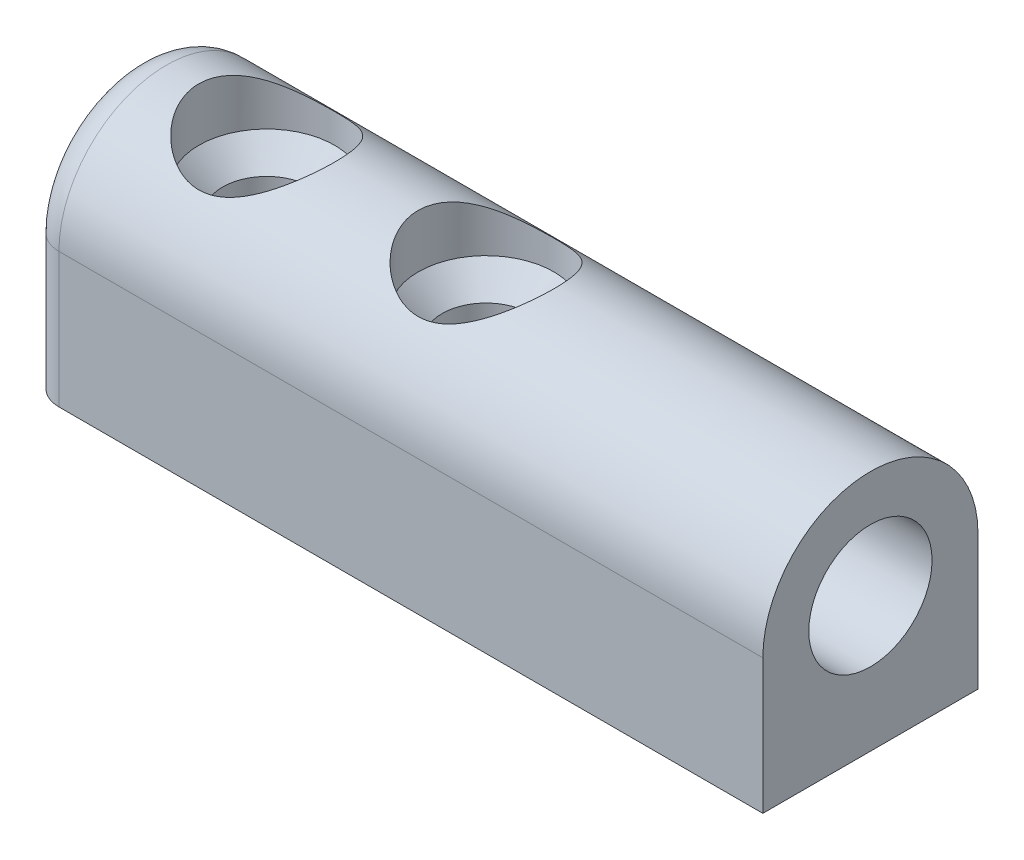
ISO-10303-21;
HEADER;
FILE_DESCRIPTION(('STEP AP214'),'2;1');
FILE_NAME('part.step','',(''),(''),'','','');
FILE_SCHEMA(('AUTOMOTIVE_DESIGN { 1 0 10303 214 1 1 1 1 }'));
ENDSEC;
DATA;
#1=APPLICATION_CONTEXT('core data for automotive mechanical design processes');
#2=APPLICATION_PROTOCOL_DEFINITION('international standard','automotive_design',2000,#1);
#3=PRODUCT_CONTEXT('',#1,'mechanical');
#4=PRODUCT('Part','Part','',(#3));
#5=PRODUCT_RELATED_PRODUCT_CATEGORY('part','',(#4));
#6=PRODUCT_DEFINITION_FORMATION('','',#4);
#7=PRODUCT_DEFINITION_CONTEXT('part definition',#1,'design');
#8=PRODUCT_DEFINITION('design','',#6,#7);
#9=PRODUCT_DEFINITION_SHAPE('','',#8);
#10=(LENGTH_UNIT() NAMED_UNIT(*) SI_UNIT(.MILLI.,.METRE.));
#11=(NAMED_UNIT(*) PLANE_ANGLE_UNIT() SI_UNIT($,.RADIAN.));
#12=(NAMED_UNIT(*) SI_UNIT($,.STERADIAN.) SOLID_ANGLE_UNIT());
#13=UNCERTAINTY_MEASURE_WITH_UNIT(LENGTH_MEASURE(1.E-05),#10,'distance_accuracy_value','');
#14=(GEOMETRIC_REPRESENTATION_CONTEXT(3) GLOBAL_UNCERTAINTY_ASSIGNED_CONTEXT((#13)) GLOBAL_UNIT_ASSIGNED_CONTEXT((#10,
#11,#12)) REPRESENTATION_CONTEXT('',''));
#15=CARTESIAN_POINT('',(0.,0.,0.));
#16=DIRECTION('',(0.,0.,1.));
#17=DIRECTION('',(1.,0.,0.));
#18=AXIS2_PLACEMENT_3D('',#15,#16,#17);
#19=CARTESIAN_POINT('',(-11.3,5.15,0.));
#20=DIRECTION('',(0.,-1.,0.));
#21=DIRECTION('',(0.,0.,-1.));
#22=AXIS2_PLACEMENT_3D('',#19,#20,#21);
#23=CYLINDRICAL_SURFACE('',#22,3.25);
#24=CARTESIAN_POINT('',(-11.3,2.59980620446174,0.));
#25=DIRECTION('',(0.,1.,0.));
#26=DIRECTION('',(0.,0.,1.));
#27=AXIS2_PLACEMENT_3D('',#24,#25,#26);
#28=CIRCLE('',#27,3.25);
#29=CARTESIAN_POINT('',(-11.3,2.59980620446174,3.25));
#30=VERTEX_POINT('',#29);
#31=EDGE_CURVE('E11',#30,#30,#28,.F.);
#32=ORIENTED_EDGE('',*,*,#31,.T.);
#33=EDGE_LOOP('',(#32));
#34=FACE_BOUND('',#33,.T.);
#35=CARTESIAN_POINT('',(-14.55,5.15,0.));
#36=CARTESIAN_POINT('',(-14.5500000147463,5.15000000420325,-0.0824631102301969));
#37=CARTESIAN_POINT('',(-14.5468573318001,5.14801501046899,-0.164926473400708));
#38=CARTESIAN_POINT('',(-14.5343324164339,5.14012478994622,-0.329218697010088));
#39=CARTESIAN_POINT('',(-14.524947704226,5.13421800513873,-0.41104729219725));
#40=CARTESIAN_POINT('',(-14.5000538313873,5.11861793148003,-0.573511125565467));
#41=CARTESIAN_POINT('',(-14.4845368050376,5.10891977973932,-0.654144692565212));
#42=CARTESIAN_POINT('',(-14.4475948864072,5.08597559790391,-0.81354337110015));
#43=CARTESIAN_POINT('',(-14.4261674940984,5.07272806652374,-0.892307676609958));
#44=CARTESIAN_POINT('',(-14.3536594200712,5.02825575256356,-1.12415930018388));
#45=CARTESIAN_POINT('',(-14.294196462155,4.99220026757494,-1.27379915933417));
#46=CARTESIAN_POINT('',(-14.1553786642358,4.91019990402799,-1.56036223857413));
#47=CARTESIAN_POINT('',(-14.076025406428,4.86425581211051,-1.69728646895532));
#48=CARTESIAN_POINT('',(-13.8926086032889,4.76186457025209,-1.96712720518533));
#49=CARTESIAN_POINT('',(-13.7870684197118,4.70486921425626,-2.09883009258909));
#50=CARTESIAN_POINT('',(-13.5576889835868,4.58774736224651,-2.34383547063853));
#51=CARTESIAN_POINT('',(-13.4338248768132,4.52761668642131,-2.457112523684));
#52=CARTESIAN_POINT('',(-13.1512257275308,4.40100825289756,-2.67805240181015));
#53=CARTESIAN_POINT('',(-12.9900369860389,4.33480612655313,-2.782760225939));
#54=CARTESIAN_POINT('',(-12.6484883588191,4.21344724270617,-2.9633135802799));
#55=CARTESIAN_POINT('',(-12.4681617479163,4.15827177977478,-3.03920818895198));
#56=CARTESIAN_POINT('',(-12.1416969478238,4.0804900475677,-3.14247212521559));
#57=CARTESIAN_POINT('',(-11.9990768318724,4.05313239488309,-3.17735920456733));
#58=CARTESIAN_POINT('',(-11.7084899493867,4.01326109216791,-3.227583887268));
#59=CARTESIAN_POINT('',(-11.5605312899255,4.00072583601166,-3.2429499482088));
#60=CARTESIAN_POINT('',(-11.262997859498,3.99239403063824,-3.25320544283478));
#61=CARTESIAN_POINT('',(-11.1134197239337,3.99664443701595,-3.24803743502481));
#62=CARTESIAN_POINT('',(-10.8176657098266,4.02130084823514,-3.21745197853596));
#63=CARTESIAN_POINT('',(-10.6714926920464,4.04171996643311,-3.19201809345977));
#64=CARTESIAN_POINT('',(-10.3900172137584,4.09504491191693,-3.12328558526757));
#65=CARTESIAN_POINT('',(-10.2545323876842,4.12761819525283,-3.08046026288364));
#66=CARTESIAN_POINT('',(-9.99241304726404,4.20165943027176,-2.97867616334198));
#67=CARTESIAN_POINT('',(-9.86578166182795,4.2431305056814,-2.91971171825144));
#68=CARTESIAN_POINT('',(-9.59943290141388,4.33978329186634,-2.77447913219011));
#69=CARTESIAN_POINT('',(-9.46178450207523,4.39607385047099,-2.68515416932122));
#70=CARTESIAN_POINT('',(-9.20192045361811,4.51091322124756,-2.48742559698068));
#71=CARTESIAN_POINT('',(-9.07972110648048,4.56946433515169,-2.37900211849672));
#72=CARTESIAN_POINT('',(-8.83272659983234,4.69405869220209,-2.12406525820926));
#73=CARTESIAN_POINT('',(-8.71108844713086,4.75966214299113,-1.97420825711635));
#74=CARTESIAN_POINT('',(-8.54895190164851,4.85039034030682,-1.7331023774508));
#75=CARTESIAN_POINT('',(-8.49827194569788,4.8793667444912,-1.64996583875332));
#76=CARTESIAN_POINT('',(-8.40420350413203,4.93398059514154,-1.47864631655992));
#77=CARTESIAN_POINT('',(-8.3608105261422,4.95962009657627,-1.39046648750906));
#78=CARTESIAN_POINT('',(-8.28387377975831,5.00560856281508,-1.21419081106441));
#79=CARTESIAN_POINT('',(-8.24994255907906,5.0261596732609,-1.12631678438054));
#80=CARTESIAN_POINT('',(-8.18965152965997,5.06297314341868,-0.947182435754089));
#81=CARTESIAN_POINT('',(-8.16328731635556,5.07923799759945,-0.855924118798906));
#82=CARTESIAN_POINT('',(-8.11856513510388,5.10697761199126,-0.670840945974954));
#83=CARTESIAN_POINT('',(-8.10019964650373,5.11845687133266,-0.577018589510135));
#84=CARTESIAN_POINT('',(-8.07178181218448,5.13626995915213,-0.387645929485475));
#85=CARTESIAN_POINT('',(-8.06172797917773,5.14260470818528,-0.292095938196902));
#86=CARTESIAN_POINT('',(-8.05100699432152,5.14936334380235,-0.114848262798939));
#87=CARTESIAN_POINT('',(-8.04914703020952,5.15053826613769,-0.033248592011485));
#88=CARTESIAN_POINT('',(-8.05157085188034,5.14900871652198,0.129850620936843));
#89=CARTESIAN_POINT('',(-8.05585651048719,5.14630306199949,0.211350124996769));
#90=CARTESIAN_POINT('',(-8.07051250482944,5.13707664154087,0.373544633283657));
#91=CARTESIAN_POINT('',(-8.0808799739059,5.13055767301289,0.454239998329225));
#92=CARTESIAN_POINT('',(-8.10754591023973,5.11386923364644,0.614271754363323));
#93=CARTESIAN_POINT('',(-8.12384665933455,5.10369835836787,0.693607610200198));
#94=CARTESIAN_POINT('',(-8.17968399194462,5.06907481174538,0.921892246952391));
#95=CARTESIAN_POINT('',(-8.22685586762363,5.04005522052217,1.06836704652511));
#96=CARTESIAN_POINT('',(-8.34020089815808,4.97175800545943,1.35105353585946));
#97=CARTESIAN_POINT('',(-8.4063771232036,4.93247872423959,1.4872635628347));
#98=CARTESIAN_POINT('',(-8.56312016441515,4.8421067494015,1.76045283530247));
#99=CARTESIAN_POINT('',(-8.65546272207768,4.79022605945554,1.89615058772727));
#100=CARTESIAN_POINT('',(-8.85826039755557,4.68132146492193,2.15104444042242));
#101=CARTESIAN_POINT('',(-8.96873523511076,4.62429199150468,2.27022231129784));
#102=CARTESIAN_POINT('',(-9.22354600059858,4.50082357951378,2.50707794854024));
#103=CARTESIAN_POINT('',(-9.37047401728254,4.43424450478045,2.62190705829337));
#104=CARTESIAN_POINT('',(-9.68368178941835,4.30720909196767,2.82575198103522));
#105=CARTESIAN_POINT('',(-9.84995002912769,4.24674915007918,2.91478304579907));
#106=CARTESIAN_POINT('',(-10.1632921910834,4.15147135366619,3.04845714760913));
#107=CARTESIAN_POINT('',(-10.3072358397925,4.11393650415722,3.09847041932707));
#108=CARTESIAN_POINT('',(-10.6033917248045,4.05270166089385,3.17815454856359));
#109=CARTESIAN_POINT('',(-10.7555903631929,4.0289796279642,3.20785782516815));
#110=CARTESIAN_POINT('',(-11.0654259503196,3.99889777830263,3.24529527417289));
#111=CARTESIAN_POINT('',(-11.2230908095799,3.99264673565918,3.25289182246868));
#112=CARTESIAN_POINT('',(-11.5374996856636,3.99896069342075,3.24512408204794));
#113=CARTESIAN_POINT('',(-11.694243458403,4.01153047384399,3.22975396037383));
#114=CARTESIAN_POINT('',(-11.9878664673406,4.05139703421064,3.17955333252038));
#115=CARTESIAN_POINT('',(-12.1252716237822,4.07728258415256,3.14657780573012));
#116=CARTESIAN_POINT('',(-12.392456327854,4.13963170705417,3.06408395610836));
#117=CARTESIAN_POINT('',(-12.5222325154283,4.17609989960802,3.01455840733492));
#118=CARTESIAN_POINT('',(-12.7903268087078,4.2617723334145,2.89242084196273));
#119=CARTESIAN_POINT('',(-12.927259472079,4.31204818172824,2.81753508506086));
#120=CARTESIAN_POINT('',(-13.1879304085202,4.41701590783482,2.64995429672589));
#121=CARTESIAN_POINT('',(-13.3116581194741,4.47171126007927,2.55724517267429));
#122=CARTESIAN_POINT('',(-13.5688320406241,4.59262206254265,2.33442353181077));
#123=CARTESIAN_POINT('',(-13.6990114309333,4.65888470543601,2.20054049029774));
#124=CARTESIAN_POINT('',(-13.9358816328046,4.78516888297203,1.91040243487801));
#125=CARTESIAN_POINT('',(-14.0425561933009,4.84518608452686,1.75413206495579));
#126=CARTESIAN_POINT('',(-14.1824674470493,4.92617225366746,1.50437796500596));
#127=CARTESIAN_POINT('',(-14.2259526038251,4.95178633229026,1.41800580481925));
#128=CARTESIAN_POINT('',(-14.3053606869851,4.99911701166789,1.2408515931269));
#129=CARTESIAN_POINT('',(-14.3412879558149,5.02083584940126,1.1500721109921));
#130=CARTESIAN_POINT('',(-14.4049646471758,5.05966121416014,0.96501157376027));
#131=CARTESIAN_POINT('',(-14.4327355145149,5.07677982582298,0.870740448203329));
#132=CARTESIAN_POINT('',(-14.4797245418602,5.10590901189784,0.679371822175125));
#133=CARTESIAN_POINT('',(-14.4989488007984,5.11792322857695,0.582276390040316));
#134=CARTESIAN_POINT('',(-14.5257566301638,5.13472688252045,0.404381762569918));
#135=CARTESIAN_POINT('',(-14.5348359178619,5.14044180345248,0.323891462395914));
#136=CARTESIAN_POINT('',(-14.5469577703648,5.14807846998466,0.162267547759081));
#137=CARTESIAN_POINT('',(-14.5499999854914,5.1499999958645,0.0811338963054397));
#138=CARTESIAN_POINT('',(-14.55,5.15,0.));
#139=B_SPLINE_CURVE_WITH_KNOTS('',3,(#35,#36,#37,#38,#39,#40,#41,#42,#43,#44,#45,#46,#47,#48,
#49,#50,#51,#52,#53,#54,#55,#56,#57,#58,#59,#60,#61,#62,#63,#64,#65,#66,#67,#68,#69,#70,#71,#72,
#73,#74,#75,#76,#77,#78,#79,#80,#81,#82,#83,#84,#85,#86,#87,#88,#89,#90,#91,#92,#93,#94,#95,#96,
#97,#98,#99,#100,#101,#102,#103,#104,#105,#106,#107,#108,#109,#110,#111,#112,#113,#114,#115,
#116,#117,#118,#119,#120,#121,#122,#123,#124,#125,#126,#127,#128,#129,#130,#131,#132,#133,#134,
#135,#136,#137,#138),.UNSPECIFIED.,.T.,.F.,(4,2,2,2,2,2,2,2,2,2,2,2,2,2,2,2,2,2,2,2,2,2,2,2,2,2,
2,2,2,2,2,2,2,2,2,2,2,2,2,2,2,2,2,2,2,2,2,2,2,2,2,4),(0.,0.247306259755544,0.494710826272478,
0.742433765900136,0.990261651070475,1.4829230381,1.97554524828364,2.50789333177357,
3.04097021751406,3.64794338697618,4.2538779910726,4.70008670221317,5.14564418445024,
5.59244893444222,6.03961642938153,6.47535288295667,6.9112425605263,7.42975088559886,
7.94880185801191,8.55697602201867,8.86138229384838,9.16560020670763,9.45441443853259,
9.74306021633956,10.031434011304,10.3197561934858,10.564329867415,10.8089780888433,
11.0535110879798,11.2981382298385,11.765780099064,12.2334975592957,12.7479216065956,
13.2629088680205,13.8543403388998,14.4454214394186,14.9143983289138,15.3826248726454,
15.8537601614703,16.32501512717,16.7543016838096,17.1837759176324,17.6739553771918,
18.1645240188811,18.7563673635887,19.3486186293002,19.64834578597,19.9479002587718,
20.2466599440773,20.545206088383,20.7885119530727,21.0318319100653),.UNSPECIFIED.);
#140=CARTESIAN_POINT('',(-14.55,5.15,0.));
#141=VERTEX_POINT('',#140);
#142=EDGE_CURVE('E132',#141,#141,#139,.T.);
#143=ORIENTED_EDGE('',*,*,#142,.F.);
#144=EDGE_LOOP('',(#143));
#145=FACE_BOUND('',#144,.T.);
#146=ADVANCED_FACE('F32',(#34,#145),#23,.F.);
#147=CARTESIAN_POINT('',(-0.8,5.15,0.));
#148=DIRECTION('',(0.,-1.,0.));
#149=DIRECTION('',(0.,0.,-1.));
#150=AXIS2_PLACEMENT_3D('',#147,#148,#149);
#151=CYLINDRICAL_SURFACE('',#150,3.25);
#152=CARTESIAN_POINT('',(-0.8,2.59980620446174,0.));
#153=DIRECTION('',(0.,1.,0.));
#154=DIRECTION('',(0.,0.,1.));
#155=AXIS2_PLACEMENT_3D('',#152,#153,#154);
#156=CIRCLE('',#155,3.25);
#157=CARTESIAN_POINT('',(-0.8,2.59980620446174,3.25));
#158=VERTEX_POINT('',#157);
#159=EDGE_CURVE('E40',#158,#158,#156,.F.);
#160=ORIENTED_EDGE('',*,*,#159,.T.);
#161=EDGE_LOOP('',(#160));
#162=FACE_BOUND('',#161,.T.);
#163=CARTESIAN_POINT('',(-4.05,5.15,0.));
#164=CARTESIAN_POINT('',(-4.05000001474633,5.15000000420325,-0.0824631102301968));
#165=CARTESIAN_POINT('',(-4.0468573318001,5.14801501046899,-0.164926473400708));
#166=CARTESIAN_POINT('',(-4.03433241643392,5.14012478994622,-0.329218697010087));
#167=CARTESIAN_POINT('',(-4.02494770422599,5.13421800513873,-0.41104729219725));
#168=CARTESIAN_POINT('',(-4.00005383138732,5.11861793148003,-0.573511125565466));
#169=CARTESIAN_POINT('',(-3.98453680503763,5.10891977973932,-0.654144692565212));
#170=CARTESIAN_POINT('',(-3.94759488640724,5.08597559790391,-0.81354337110015));
#171=CARTESIAN_POINT('',(-3.9261674940984,5.07272806652374,-0.892307676609958));
#172=CARTESIAN_POINT('',(-3.85365942007119,5.02825575256356,-1.12415930018388));
#173=CARTESIAN_POINT('',(-3.79419646215501,4.99220026757494,-1.27379915933417));
#174=CARTESIAN_POINT('',(-3.65537866423584,4.91019990402799,-1.56036223857413));
#175=CARTESIAN_POINT('',(-3.576025406428,4.86425581211051,-1.69728646895532));
#176=CARTESIAN_POINT('',(-3.39260860328894,4.76186457025209,-1.96712720518533));
#177=CARTESIAN_POINT('',(-3.28706841971181,4.70486921425627,-2.09883009258909));
#178=CARTESIAN_POINT('',(-3.05768898358682,4.58774736224651,-2.34383547063853));
#179=CARTESIAN_POINT('',(-2.9338248768132,4.52761668642131,-2.457112523684));
#180=CARTESIAN_POINT('',(-2.65122572753085,4.40100825289756,-2.67805240181015));
#181=CARTESIAN_POINT('',(-2.49003698603885,4.33480612655313,-2.782760225939));
#182=CARTESIAN_POINT('',(-2.14848835881913,4.21344724270617,-2.9633135802799));
#183=CARTESIAN_POINT('',(-1.96816174791625,4.15827177977478,-3.03920818895198));
#184=CARTESIAN_POINT('',(-1.64169694782381,4.0804900475677,-3.14247212521559));
#185=CARTESIAN_POINT('',(-1.49907683187245,4.05313239488309,-3.17735920456733));
#186=CARTESIAN_POINT('',(-1.20848994938668,4.01326109216791,-3.227583887268));
#187=CARTESIAN_POINT('',(-1.0605312899255,4.00072583601166,-3.2429499482088));
#188=CARTESIAN_POINT('',(-0.762997859498003,3.99239403063824,-3.25320544283478));
#189=CARTESIAN_POINT('',(-0.613419723933668,3.99664443701595,-3.24803743502481));
#190=CARTESIAN_POINT('',(-0.317665709826614,4.02130084823514,-3.21745197853596));
#191=CARTESIAN_POINT('',(-0.17149269204639,4.04171996643311,-3.19201809345977));
#192=CARTESIAN_POINT('',(0.109982786241596,4.09504491191693,-3.12328558526757));
#193=CARTESIAN_POINT('',(0.245467612315824,4.12761819525283,-3.08046026288364));
#194=CARTESIAN_POINT('',(0.507586952735964,4.20165943027176,-2.97867616334199));
#195=CARTESIAN_POINT('',(0.634218338172046,4.2431305056814,-2.91971171825144));
#196=CARTESIAN_POINT('',(0.900567098586119,4.33978329186634,-2.77447913219011));
#197=CARTESIAN_POINT('',(1.03821549792477,4.39607385047098,-2.68515416932122));
#198=CARTESIAN_POINT('',(1.29807954638189,4.51091322124755,-2.48742559698068));
#199=CARTESIAN_POINT('',(1.42027889351952,4.56946433515169,-2.37900211849673));
#200=CARTESIAN_POINT('',(1.66727340016766,4.69405869220209,-2.12406525820926));
#201=CARTESIAN_POINT('',(1.78891155286914,4.75966214299113,-1.97420825711635));
#202=CARTESIAN_POINT('',(1.95104809835149,4.85039034030681,-1.7331023774508));
#203=CARTESIAN_POINT('',(2.00172805430212,4.8793667444912,-1.64996583875332));
#204=CARTESIAN_POINT('',(2.09579649586797,4.93398059514154,-1.47864631655992));
#205=CARTESIAN_POINT('',(2.1391894738578,4.95962009657627,-1.39046648750907));
#206=CARTESIAN_POINT('',(2.21612622024169,5.00560856281508,-1.21419081106441));
#207=CARTESIAN_POINT('',(2.25005744092094,5.0261596732609,-1.12631678438054));
#208=CARTESIAN_POINT('',(2.31034847034003,5.06297314341868,-0.947182435754091));
#209=CARTESIAN_POINT('',(2.33671268364444,5.07923799759945,-0.855924118798907));
#210=CARTESIAN_POINT('',(2.38143486489612,5.10697761199126,-0.670840945974954));
#211=CARTESIAN_POINT('',(2.39980035349627,5.11845687133266,-0.577018589510134));
#212=CARTESIAN_POINT('',(2.42821818781552,5.13626995915213,-0.387645929485475));
#213=CARTESIAN_POINT('',(2.43827202082227,5.14260470818528,-0.292095938196902));
#214=CARTESIAN_POINT('',(2.44899300567848,5.14936334380235,-0.11484826279894));
#215=CARTESIAN_POINT('',(2.45085296979048,5.15053826613769,-0.0332485920114868));
#216=CARTESIAN_POINT('',(2.44842914811966,5.14900871652198,0.129850620936841));
#217=CARTESIAN_POINT('',(2.44414348951282,5.14630306199949,0.211350124996768));
#218=CARTESIAN_POINT('',(2.42948749517057,5.13707664154087,0.373544633283656));
#219=CARTESIAN_POINT('',(2.4191200260941,5.13055767301289,0.454239998329223));
#220=CARTESIAN_POINT('',(2.39245408976026,5.11386923364644,0.614271754363321));
#221=CARTESIAN_POINT('',(2.37615334066545,5.10369835836787,0.693607610200197));
#222=CARTESIAN_POINT('',(2.32031600805538,5.06907481174538,0.92189224695239));
#223=CARTESIAN_POINT('',(2.27314413237637,5.04005522052217,1.06836704652511));
#224=CARTESIAN_POINT('',(2.15979910184192,4.97175800545943,1.35105353585946));
#225=CARTESIAN_POINT('',(2.0936228767964,4.93247872423959,1.4872635628347));
#226=CARTESIAN_POINT('',(1.93687983558486,4.8421067494015,1.76045283530246));
#227=CARTESIAN_POINT('',(1.84453727792232,4.79022605945554,1.89615058772727));
#228=CARTESIAN_POINT('',(1.64173960244443,4.68132146492193,2.15104444042241));
#229=CARTESIAN_POINT('',(1.53126476488924,4.62429199150468,2.27022231129784));
#230=CARTESIAN_POINT('',(1.27645399940142,4.50082357951378,2.50707794854024));
#231=CARTESIAN_POINT('',(1.12952598271746,4.43424450478045,2.62190705829337));
#232=CARTESIAN_POINT('',(0.816318210581648,4.30720909196768,2.82575198103522));
#233=CARTESIAN_POINT('',(0.650049970872315,4.24674915007918,2.91478304579907));
#234=CARTESIAN_POINT('',(0.33670780891658,4.15147135366619,3.04845714760913));
#235=CARTESIAN_POINT('',(0.192764160207511,4.11393650415722,3.09847041932707));
#236=CARTESIAN_POINT('',(-0.103391724804527,4.05270166089385,3.17815454856359));
#237=CARTESIAN_POINT('',(-0.255590363192863,4.0289796279642,3.20785782516815));
#238=CARTESIAN_POINT('',(-0.565425950319555,3.99889777830263,3.24529527417289));
#239=CARTESIAN_POINT('',(-0.723090809579874,3.99264673565918,3.25289182246868));
#240=CARTESIAN_POINT('',(-1.03749968566357,3.99896069342075,3.24512408204794));
#241=CARTESIAN_POINT('',(-1.19424345840297,4.01153047384398,3.22975396037383));
#242=CARTESIAN_POINT('',(-1.48786646734056,4.05139703421064,3.17955333252038));
#243=CARTESIAN_POINT('',(-1.62527162378217,4.07728258415256,3.14657780573012));
#244=CARTESIAN_POINT('',(-1.89245632785396,4.13963170705417,3.06408395610836));
#245=CARTESIAN_POINT('',(-2.02223251542831,4.17609989960802,3.01455840733492));
#246=CARTESIAN_POINT('',(-2.29032680870775,4.2617723334145,2.89242084196273));
#247=CARTESIAN_POINT('',(-2.42725947207903,4.31204818172823,2.81753508506087));
#248=CARTESIAN_POINT('',(-2.68793040852023,4.41701590783482,2.64995429672589));
#249=CARTESIAN_POINT('',(-2.81165811947406,4.47171126007926,2.55724517267429));
#250=CARTESIAN_POINT('',(-3.06883204062407,4.59262206254264,2.33442353181078));
#251=CARTESIAN_POINT('',(-3.19901143093331,4.658884705436,2.20054049029774));
#252=CARTESIAN_POINT('',(-3.43588163280463,4.78516888297203,1.91040243487802));
#253=CARTESIAN_POINT('',(-3.54255619330086,4.84518608452686,1.7541320649558));
#254=CARTESIAN_POINT('',(-3.68246744704933,4.92617225366745,1.50437796500597));
#255=CARTESIAN_POINT('',(-3.72595260382513,4.95178633229026,1.41800580481926));
#256=CARTESIAN_POINT('',(-3.80536068698513,4.99911701166789,1.24085159312691));
#257=CARTESIAN_POINT('',(-3.84128795581493,5.02083584940126,1.15007211099211));
#258=CARTESIAN_POINT('',(-3.90496464717581,5.05966121416014,0.965011573760281));
#259=CARTESIAN_POINT('',(-3.9327355145149,5.07677982582297,0.870740448203339));
#260=CARTESIAN_POINT('',(-3.9797245418602,5.10590901189784,0.679371822175133));
#261=CARTESIAN_POINT('',(-3.99894880079841,5.11792322857695,0.582276390040324));
#262=CARTESIAN_POINT('',(-4.02575663016384,5.13472688252045,0.404381762569926));
#263=CARTESIAN_POINT('',(-4.03483591786194,5.14044180345248,0.323891462395921));
#264=CARTESIAN_POINT('',(-4.04695777036476,5.14807846998466,0.162267547759085));
#265=CARTESIAN_POINT('',(-4.04999998549136,5.1499999958645,0.0811338963054418));
#266=CARTESIAN_POINT('',(-4.05,5.15,0.));
#267=B_SPLINE_CURVE_WITH_KNOTS('',3,(#163,#164,#165,#166,#167,#168,#169,#170,#171,#172,#173,
#174,#175,#176,#177,#178,#179,#180,#181,#182,#183,#184,#185,#186,#187,#188,#189,#190,#191,#192,
#193,#194,#195,#196,#197,#198,#199,#200,#201,#202,#203,#204,#205,#206,#207,#208,#209,#210,#211,
#212,#213,#214,#215,#216,#217,#218,#219,#220,#221,#222,#223,#224,#225,#226,#227,#228,#229,#230,
#231,#232,#233,#234,#235,#236,#237,#238,#239,#240,#241,#242,#243,#244,#245,#246,#247,#248,#249,
#250,#251,#252,#253,#254,#255,#256,#257,#258,#259,#260,#261,#262,#263,#264,#265,#266),
.UNSPECIFIED.,.T.,.F.,(4,2,2,2,2,2,2,2,2,2,2,2,2,2,2,2,2,2,2,2,2,2,2,2,2,2,2,2,2,2,2,2,2,2,2,2,
2,2,2,2,2,2,2,2,2,2,2,2,2,2,2,4),(0.,0.247306259755544,0.494710826272477,0.742433765900136,
0.990261651070474,1.4829230381,1.97554524828364,2.50789333177357,3.04097021751406,
3.64794338697618,4.25387799107259,4.70008670221317,5.14564418445023,5.59244893444222,
6.03961642938152,6.47535288295667,6.9112425605263,7.42975088559886,7.9488018580119,
8.55697602201866,8.86138229384837,9.16560020670763,9.45441443853258,9.74306021633956,
10.031434011304,10.3197561934858,10.564329867415,10.8089780888433,11.0535110879798,
11.2981382298385,11.765780099064,12.2334975592957,12.7479216065956,13.2629088680205,
13.8543403388998,14.4454214394186,14.9143983289138,15.3826248726454,15.8537601614703,
16.32501512717,16.7543016838095,17.1837759176324,17.6739553771918,18.1645240188811,
18.7563673635887,19.3486186293002,19.64834578597,19.9479002587718,20.2466599440773,
20.545206088383,20.7885119530726,21.0318319100653),.UNSPECIFIED.);
#268=CARTESIAN_POINT('',(-4.05,5.15,0.));
#269=VERTEX_POINT('',#268);
#270=EDGE_CURVE('E181',#269,#269,#267,.T.);
#271=ORIENTED_EDGE('',*,*,#270,.F.);
#272=EDGE_LOOP('',(#271));
#273=FACE_BOUND('',#272,.T.);
#274=ADVANCED_FACE('F142',(#162,#273),#151,.F.);
#275=CARTESIAN_POINT('',(17.6,0.,0.));
#276=DIRECTION('',(-1.,0.,0.));
#277=DIRECTION('',(0.,0.,1.));
#278=AXIS2_PLACEMENT_3D('',#275,#276,#277);
#279=CYLINDRICAL_SURFACE('',#278,2.95);
#280=CARTESIAN_POINT('',(17.6,0.,0.));
#281=DIRECTION('',(1.,0.,0.));
#282=DIRECTION('',(0.,0.,-1.));
#283=AXIS2_PLACEMENT_3D('',#280,#281,#282);
#284=CIRCLE('',#283,2.95);
#285=CARTESIAN_POINT('',(17.6,0.,-2.95));
#286=VERTEX_POINT('',#285);
#287=EDGE_CURVE('E115',#286,#286,#284,.T.);
#288=ORIENTED_EDGE('',*,*,#287,.T.);
#289=EDGE_LOOP('',(#288));
#290=FACE_BOUND('',#289,.T.);
#291=CARTESIAN_POINT('',(2.9,0.,0.));
#292=DIRECTION('',(-1.,0.,0.));
#293=DIRECTION('',(0.,0.,1.));
#294=AXIS2_PLACEMENT_3D('',#291,#292,#293);
#295=CIRCLE('',#294,2.95);
#296=CARTESIAN_POINT('',(2.9,0.,2.95));
#297=VERTEX_POINT('',#296);
#298=EDGE_CURVE('E113',#297,#297,#295,.T.);
#299=ORIENTED_EDGE('',*,*,#298,.T.);
#300=EDGE_LOOP('',(#299));
#301=FACE_BOUND('',#300,.T.);
#302=ADVANCED_FACE('F165',(#290,#301),#279,.F.);
#303=CARTESIAN_POINT('',(17.6,0.,0.));
#304=DIRECTION('',(1.,0.,0.));
#305=DIRECTION('',(0.,0.,-1.));
#306=AXIS2_PLACEMENT_3D('',#303,#304,#305);
#307=PLANE('',#306);
#308=CARTESIAN_POINT('',(17.6,0.,0.));
#309=DIRECTION('',(1.,0.,0.));
#310=DIRECTION('',(0.,0.,-1.));
#311=AXIS2_PLACEMENT_3D('',#308,#309,#310);
#312=CIRCLE('',#311,5.15);
#313=CARTESIAN_POINT('',(17.6,0.,-5.15));
#314=VERTEX_POINT('',#313);
#315=CARTESIAN_POINT('',(17.6,0.,5.15));
#316=VERTEX_POINT('',#315);
#317=EDGE_CURVE('E93',#314,#316,#312,.T.);
#318=ORIENTED_EDGE('',*,*,#317,.T.);
#319=DIRECTION('',(0.,-1.,0.));
#320=VECTOR('',#319,1.);
#321=CARTESIAN_POINT('',(17.6,-6.45019379553824,5.15));
#322=LINE('',#321,#320);
#323=CARTESIAN_POINT('',(17.6,-6.45019379553824,5.15));
#324=VERTEX_POINT('',#323);
#325=EDGE_CURVE('E85',#316,#324,#322,.T.);
#326=ORIENTED_EDGE('',*,*,#325,.T.);
#327=DIRECTION('',(0.,0.,-1.));
#328=VECTOR('',#327,1.);
#329=CARTESIAN_POINT('',(17.6,-6.45019379553824,-5.15));
#330=LINE('',#329,#328);
#331=CARTESIAN_POINT('',(17.6,-6.45019379553824,-5.15));
#332=VERTEX_POINT('',#331);
#333=EDGE_CURVE('E92',#324,#332,#330,.T.);
#334=ORIENTED_EDGE('',*,*,#333,.T.);
#335=DIRECTION('',(0.,1.,0.));
#336=VECTOR('',#335,1.);
#337=CARTESIAN_POINT('',(17.6,-6.45019379553824,-5.15));
#338=LINE('',#337,#336);
#339=EDGE_CURVE('E99',#332,#314,#338,.T.);
#340=ORIENTED_EDGE('',*,*,#339,.T.);
#341=EDGE_LOOP('',(#318,#326,#334,#340));
#342=FACE_BOUND('',#341,.T.);
#343=ORIENTED_EDGE('',*,*,#287,.F.);
#344=EDGE_LOOP('',(#343));
#345=FACE_BOUND('',#344,.T.);
#346=ADVANCED_FACE('F96',(#342,#345),#307,.T.);
#347=CARTESIAN_POINT('',(-17.6,0.,0.));
#348=DIRECTION('',(1.,0.,0.));
#349=DIRECTION('',(0.,0.,-1.));
#350=AXIS2_PLACEMENT_3D('',#347,#348,#349);
#351=PLANE('',#350);
#352=CARTESIAN_POINT('',(-17.6,0.,0.));
#353=DIRECTION('',(1.,0.,0.));
#354=DIRECTION('',(0.,0.,-1.));
#355=AXIS2_PLACEMENT_3D('',#352,#353,#354);
#356=CIRCLE('',#355,3.65);
#357=CARTESIAN_POINT('',(-17.6,0.,3.65));
#358=VERTEX_POINT('',#357);
#359=CARTESIAN_POINT('',(-17.6,0.,-3.65));
#360=VERTEX_POINT('',#359);
#361=EDGE_CURVE('E107',#358,#360,#356,.F.);
#362=ORIENTED_EDGE('',*,*,#361,.T.);
#363=DIRECTION('',(0.,1.,0.));
#364=VECTOR('',#363,1.);
#365=CARTESIAN_POINT('',(-17.6,0.,-3.65));
#366=LINE('',#365,#364);
#367=CARTESIAN_POINT('',(-17.6,-6.45019379553824,-3.65));
#368=VERTEX_POINT('',#367);
#369=EDGE_CURVE('E121',#360,#368,#366,.F.);
#370=ORIENTED_EDGE('',*,*,#369,.T.);
#371=DIRECTION('',(0.,0.,-1.));
#372=VECTOR('',#371,1.);
#373=CARTESIAN_POINT('',(-17.6,-6.45019379553824,-5.15));
#374=LINE('',#373,#372);
#375=CARTESIAN_POINT('',(-17.6,-6.45019379553824,3.65));
#376=VERTEX_POINT('',#375);
#377=EDGE_CURVE('E101',#376,#368,#374,.T.);
#378=ORIENTED_EDGE('',*,*,#377,.F.);
#379=DIRECTION('',(0.,-1.,0.));
#380=VECTOR('',#379,1.);
#381=CARTESIAN_POINT('',(-17.6,0.,3.65));
#382=LINE('',#381,#380);
#383=EDGE_CURVE('E119',#376,#358,#382,.F.);
#384=ORIENTED_EDGE('',*,*,#383,.T.);
#385=EDGE_LOOP('',(#362,#370,#378,#384));
#386=FACE_BOUND('',#385,.T.);
#387=ADVANCED_FACE('F189',(#386),#351,.F.);
#388=CARTESIAN_POINT('',(17.6,0.,0.));
#389=DIRECTION('',(-1.,0.,0.));
#390=DIRECTION('',(0.,0.,1.));
#391=AXIS2_PLACEMENT_3D('',#388,#389,#390);
#392=CYLINDRICAL_SURFACE('',#391,5.15);
#393=ORIENTED_EDGE('',*,*,#270,.T.);
#394=EDGE_LOOP('',(#393));
#395=FACE_BOUND('',#394,.T.);
#396=ORIENTED_EDGE('',*,*,#142,.T.);
#397=EDGE_LOOP('',(#396));
#398=FACE_BOUND('',#397,.T.);
#399=DIRECTION('',(-1.,0.,0.));
#400=VECTOR('',#399,1.);
#401=CARTESIAN_POINT('',(17.6,0.,-5.15));
#402=LINE('',#401,#400);
#403=CARTESIAN_POINT('',(-16.1,0.,-5.15));
#404=VERTEX_POINT('',#403);
#405=EDGE_CURVE('E224',#314,#404,#402,.T.);
#406=ORIENTED_EDGE('',*,*,#405,.T.);
#407=CARTESIAN_POINT('',(-16.1,0.,0.));
#408=DIRECTION('',(1.,0.,0.));
#409=DIRECTION('',(0.,0.,-1.));
#410=AXIS2_PLACEMENT_3D('',#407,#408,#409);
#411=CIRCLE('',#410,5.15);
#412=CARTESIAN_POINT('',(-16.1,0.,5.15));
#413=VERTEX_POINT('',#412);
#414=EDGE_CURVE('E47',#404,#413,#411,.T.);
#415=ORIENTED_EDGE('',*,*,#414,.T.);
#416=DIRECTION('',(-1.,0.,0.));
#417=VECTOR('',#416,1.);
#418=CARTESIAN_POINT('',(17.6,0.,5.15));
#419=LINE('',#418,#417);
#420=EDGE_CURVE('E88',#316,#413,#419,.T.);
#421=ORIENTED_EDGE('',*,*,#420,.F.);
#422=ORIENTED_EDGE('',*,*,#317,.F.);
#423=EDGE_LOOP('',(#406,#415,#421,#422));
#424=FACE_BOUND('',#423,.T.);
#425=ADVANCED_FACE('F103',(#395,#398,#424),#392,.T.);
#426=CARTESIAN_POINT('',(17.6,-6.45019379553824,5.15));
#427=DIRECTION('',(0.,0.,-1.));
#428=DIRECTION('',(0.,1.,0.));
#429=AXIS2_PLACEMENT_3D('',#426,#427,#428);
#430=PLANE('',#429);
#431=ORIENTED_EDGE('',*,*,#420,.T.);
#432=DIRECTION('',(0.,-1.,0.));
#433=VECTOR('',#432,1.);
#434=CARTESIAN_POINT('',(-16.1,-6.45019379553824,5.15));
#435=LINE('',#434,#433);
#436=CARTESIAN_POINT('',(-16.1,-6.45019379553824,5.15));
#437=VERTEX_POINT('',#436);
#438=EDGE_CURVE('E54',#413,#437,#435,.T.);
#439=ORIENTED_EDGE('',*,*,#438,.T.);
#440=DIRECTION('',(-1.,0.,0.));
#441=VECTOR('',#440,1.);
#442=CARTESIAN_POINT('',(17.6,-6.45019379553824,5.15));
#443=LINE('',#442,#441);
#444=EDGE_CURVE('E89',#324,#437,#443,.T.);
#445=ORIENTED_EDGE('',*,*,#444,.F.);
#446=ORIENTED_EDGE('',*,*,#325,.F.);
#447=EDGE_LOOP('',(#431,#439,#445,#446));
#448=FACE_BOUND('',#447,.T.);
#449=ADVANCED_FACE('F87',(#448),#430,.F.);
#450=CARTESIAN_POINT('',(17.6,-6.45019379553824,-5.15));
#451=DIRECTION('',(0.,1.,0.));
#452=DIRECTION('',(0.,0.,1.));
#453=AXIS2_PLACEMENT_3D('',#450,#451,#452);
#454=PLANE('',#453);
#455=ORIENTED_EDGE('',*,*,#377,.T.);
#456=CARTESIAN_POINT('',(-16.1,-6.45019379553824,-3.65));
#457=DIRECTION('',(0.,1.,0.));
#458=DIRECTION('',(0.,0.,1.));
#459=AXIS2_PLACEMENT_3D('',#456,#457,#458);
#460=CIRCLE('',#459,1.5);
#461=CARTESIAN_POINT('',(-16.1,-6.45019379553824,-5.15));
#462=VERTEX_POINT('',#461);
#463=EDGE_CURVE('E125',#368,#462,#460,.F.);
#464=ORIENTED_EDGE('',*,*,#463,.T.);
#465=DIRECTION('',(-1.,0.,0.));
#466=VECTOR('',#465,1.);
#467=CARTESIAN_POINT('',(17.6,-6.45019379553824,-5.15));
#468=LINE('',#467,#466);
#469=EDGE_CURVE('E109',#332,#462,#468,.T.);
#470=ORIENTED_EDGE('',*,*,#469,.F.);
#471=ORIENTED_EDGE('',*,*,#333,.F.);
#472=ORIENTED_EDGE('',*,*,#444,.T.);
#473=CARTESIAN_POINT('',(-16.1,-6.45019379553824,3.65));
#474=DIRECTION('',(0.,1.,0.));
#475=DIRECTION('',(0.,0.,1.));
#476=AXIS2_PLACEMENT_3D('',#473,#474,#475);
#477=CIRCLE('',#476,1.5);
#478=EDGE_CURVE('E123',#437,#376,#477,.F.);
#479=ORIENTED_EDGE('',*,*,#478,.T.);
#480=EDGE_LOOP('',(#455,#464,#470,#471,#472,#479));
#481=FACE_BOUND('',#480,.T.);
#482=CARTESIAN_POINT('',(-0.8,-6.45019379553824,0.));
#483=DIRECTION('',(0.,-1.,0.));
#484=DIRECTION('',(0.,0.,-1.));
#485=AXIS2_PLACEMENT_3D('',#482,#483,#484);
#486=CIRCLE('',#485,2.1);
#487=CARTESIAN_POINT('',(-0.8,-6.45019379553824,-2.1));
#488=VERTEX_POINT('',#487);
#489=EDGE_CURVE('E354',#488,#488,#486,.T.);
#490=ORIENTED_EDGE('',*,*,#489,.F.);
#491=EDGE_LOOP('',(#490));
#492=FACE_BOUND('',#491,.T.);
#493=CARTESIAN_POINT('',(-11.3,-6.45019379553824,0.));
#494=DIRECTION('',(0.,-1.,0.));
#495=DIRECTION('',(0.,0.,-1.));
#496=AXIS2_PLACEMENT_3D('',#493,#494,#495);
#497=CIRCLE('',#496,2.1);
#498=CARTESIAN_POINT('',(-11.3,-6.45019379553824,-2.1));
#499=VERTEX_POINT('',#498);
#500=EDGE_CURVE('E355',#499,#499,#497,.T.);
#501=ORIENTED_EDGE('',*,*,#500,.F.);
#502=EDGE_LOOP('',(#501));
#503=FACE_BOUND('',#502,.T.);
#504=ADVANCED_FACE('F214',(#481,#492,#503),#454,.F.);
#505=CARTESIAN_POINT('',(17.6,-6.45019379553824,-5.15));
#506=DIRECTION('',(0.,0.,1.));
#507=DIRECTION('',(0.,-1.,0.));
#508=AXIS2_PLACEMENT_3D('',#505,#506,#507);
#509=PLANE('',#508);
#510=ORIENTED_EDGE('',*,*,#469,.T.);
#511=DIRECTION('',(0.,1.,0.));
#512=VECTOR('',#511,1.);
#513=CARTESIAN_POINT('',(-16.1,-6.45019379553824,-5.15));
#514=LINE('',#513,#512);
#515=EDGE_CURVE('E104',#462,#404,#514,.T.);
#516=ORIENTED_EDGE('',*,*,#515,.T.);
#517=ORIENTED_EDGE('',*,*,#405,.F.);
#518=ORIENTED_EDGE('',*,*,#339,.F.);
#519=EDGE_LOOP('',(#510,#516,#517,#518));
#520=FACE_BOUND('',#519,.T.);
#521=ADVANCED_FACE('F206',(#520),#509,.F.);
#522=CARTESIAN_POINT('',(2.9,0.,0.));
#523=DIRECTION('',(-1.,0.,0.));
#524=DIRECTION('',(0.,0.,1.));
#525=AXIS2_PLACEMENT_3D('',#522,#523,#524);
#526=PLANE('',#525);
#527=ORIENTED_EDGE('',*,*,#298,.F.);
#528=EDGE_LOOP('',(#527));
#529=FACE_BOUND('',#528,.T.);
#530=ADVANCED_FACE('F172',(#529),#526,.F.);
#531=CARTESIAN_POINT('',(-16.1,-6.45019379553824,3.65));
#532=DIRECTION('',(0.,-1.,0.));
#533=DIRECTION('',(0.,0.,-1.));
#534=AXIS2_PLACEMENT_3D('',#531,#532,#533);
#535=CYLINDRICAL_SURFACE('',#534,1.5);
#536=ORIENTED_EDGE('',*,*,#478,.F.);
#537=ORIENTED_EDGE('',*,*,#438,.F.);
#538=CARTESIAN_POINT('',(-16.1,0.,3.65));
#539=DIRECTION('',(0.,1.,0.));
#540=DIRECTION('',(0.,0.,1.));
#541=AXIS2_PLACEMENT_3D('',#538,#539,#540);
#542=CIRCLE('',#541,1.5);
#543=EDGE_CURVE('E116',#358,#413,#542,.T.);
#544=ORIENTED_EDGE('',*,*,#543,.F.);
#545=ORIENTED_EDGE('',*,*,#383,.F.);
#546=EDGE_LOOP('',(#536,#537,#544,#545));
#547=FACE_BOUND('',#546,.T.);
#548=ADVANCED_FACE('F199',(#547),#535,.T.);
#549=CARTESIAN_POINT('',(-16.1,0.,0.));
#550=DIRECTION('',(1.,0.,0.));
#551=DIRECTION('',(0.,0.,-1.));
#552=AXIS2_PLACEMENT_3D('',#549,#550,#551);
#553=TOROIDAL_SURFACE('',#552,3.65,1.5);
#554=ORIENTED_EDGE('',*,*,#543,.T.);
#555=ORIENTED_EDGE('',*,*,#414,.F.);
#556=CARTESIAN_POINT('',(-16.1,0.,-3.65));
#557=DIRECTION('',(0.,-1.,0.));
#558=DIRECTION('',(0.,0.,-1.));
#559=AXIS2_PLACEMENT_3D('',#556,#557,#558);
#560=CIRCLE('',#559,1.5);
#561=EDGE_CURVE('E130',#360,#404,#560,.T.);
#562=ORIENTED_EDGE('',*,*,#561,.F.);
#563=ORIENTED_EDGE('',*,*,#361,.F.);
#564=EDGE_LOOP('',(#554,#555,#562,#563));
#565=FACE_BOUND('',#564,.T.);
#566=ADVANCED_FACE('F196',(#565),#553,.T.);
#567=CARTESIAN_POINT('',(-16.1,-6.45019379553824,-3.65));
#568=DIRECTION('',(0.,1.,0.));
#569=DIRECTION('',(0.,0.,1.));
#570=AXIS2_PLACEMENT_3D('',#567,#568,#569);
#571=CYLINDRICAL_SURFACE('',#570,1.5);
#572=ORIENTED_EDGE('',*,*,#463,.F.);
#573=ORIENTED_EDGE('',*,*,#369,.F.);
#574=ORIENTED_EDGE('',*,*,#561,.T.);
#575=ORIENTED_EDGE('',*,*,#515,.F.);
#576=EDGE_LOOP('',(#572,#573,#574,#575));
#577=FACE_BOUND('',#576,.T.);
#578=ADVANCED_FACE('F192',(#577),#571,.T.);
#579=CARTESIAN_POINT('',(-0.8,2.64980620446176,0.));
#580=DIRECTION('',(0.,-1.,0.));
#581=DIRECTION('',(0.,0.,-1.));
#582=AXIS2_PLACEMENT_3D('',#579,#580,#581);
#583=CYLINDRICAL_SURFACE('',#582,2.1);
#584=CARTESIAN_POINT('',(-0.8,1.44980620446175,0.));
#585=DIRECTION('',(0.,-1.,0.));
#586=DIRECTION('',(0.,0.,-1.));
#587=AXIS2_PLACEMENT_3D('',#584,#585,#586);
#588=CIRCLE('',#587,2.1);
#589=CARTESIAN_POINT('',(-0.8,1.44980620446175,-2.1));
#590=VERTEX_POINT('',#589);
#591=EDGE_CURVE('E129',#590,#590,#588,.F.);
#592=ORIENTED_EDGE('',*,*,#591,.T.);
#593=EDGE_LOOP('',(#592));
#594=FACE_BOUND('',#593,.T.);
#595=ORIENTED_EDGE('',*,*,#489,.T.);
#596=EDGE_LOOP('',(#595));
#597=FACE_BOUND('',#596,.T.);
#598=ADVANCED_FACE('F154',(#594,#597),#583,.F.);
#599=CARTESIAN_POINT('',(-11.3,2.64980620446176,0.));
#600=DIRECTION('',(0.,-1.,0.));
#601=DIRECTION('',(0.,0.,-1.));
#602=AXIS2_PLACEMENT_3D('',#599,#600,#601);
#603=CYLINDRICAL_SURFACE('',#602,2.1);
#604=CARTESIAN_POINT('',(-11.3,1.44980620446175,0.));
#605=DIRECTION('',(0.,-1.,0.));
#606=DIRECTION('',(0.,0.,-1.));
#607=AXIS2_PLACEMENT_3D('',#604,#605,#606);
#608=CIRCLE('',#607,2.1);
#609=CARTESIAN_POINT('',(-11.3,1.44980620446175,-2.1));
#610=VERTEX_POINT('',#609);
#611=EDGE_CURVE('E137',#610,#610,#608,.F.);
#612=ORIENTED_EDGE('',*,*,#611,.T.);
#613=EDGE_LOOP('',(#612));
#614=FACE_BOUND('',#613,.T.);
#615=ORIENTED_EDGE('',*,*,#500,.T.);
#616=EDGE_LOOP('',(#615));
#617=FACE_BOUND('',#616,.T.);
#618=ADVANCED_FACE('F147',(#614,#617),#603,.F.);
#619=CARTESIAN_POINT('',(-0.8,2.64980620446176,0.));
#620=DIRECTION('',(0.,1.,0.));
#621=DIRECTION('',(0.,0.,1.));
#622=AXIS2_PLACEMENT_3D('',#619,#620,#621);
#623=CONICAL_SURFACE('',#622,3.30000000000002,0.785398163397454);
#624=ORIENTED_EDGE('',*,*,#591,.F.);
#625=EDGE_LOOP('',(#624));
#626=FACE_BOUND('',#625,.T.);
#627=ORIENTED_EDGE('',*,*,#159,.F.);
#628=EDGE_LOOP('',(#627));
#629=FACE_BOUND('',#628,.T.);
#630=ADVANCED_FACE('F145',(#626,#629),#623,.F.);
#631=CARTESIAN_POINT('',(-11.3,2.64980620446176,0.));
#632=DIRECTION('',(0.,1.,0.));
#633=DIRECTION('',(0.,0.,1.));
#634=AXIS2_PLACEMENT_3D('',#631,#632,#633);
#635=CONICAL_SURFACE('',#634,3.30000000000002,0.785398163397454);
#636=ORIENTED_EDGE('',*,*,#611,.F.);
#637=EDGE_LOOP('',(#636));
#638=FACE_BOUND('',#637,.T.);
#639=ORIENTED_EDGE('',*,*,#31,.F.);
#640=EDGE_LOOP('',(#639));
#641=FACE_BOUND('',#640,.T.);
#642=ADVANCED_FACE('F34',(#638,#641),#635,.F.);
#643=CLOSED_SHELL('',(#146,#274,#302,#346,#387,#425,#449,#504,#521,#530,#548,#566,#578,#598,
#618,#630,#642));
#644=MANIFOLD_SOLID_BREP('B2',#643);
#645=ADVANCED_BREP_SHAPE_REPRESENTATION('',(#18,#644),#14);
#646=SHAPE_DEFINITION_REPRESENTATION(#9,#645);
ENDSEC;
END-ISO-10303-21;
